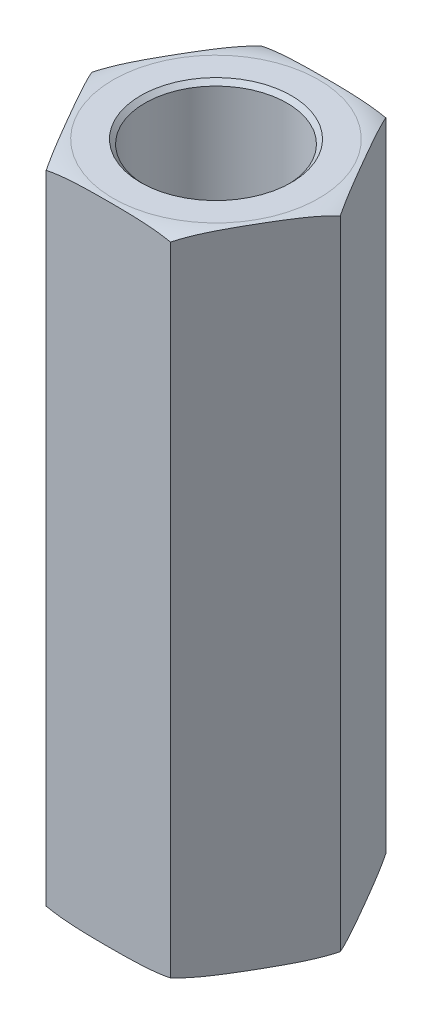
ISO-10303-21;
HEADER;
FILE_DESCRIPTION(('STEP AP214'),'2;1');
FILE_NAME('part.step','',(''),(''),'','','');
FILE_SCHEMA(('AUTOMOTIVE_DESIGN { 1 0 10303 214 1 1 1 1 }'));
ENDSEC;
DATA;
#1=APPLICATION_CONTEXT('core data for automotive mechanical design processes');
#2=APPLICATION_PROTOCOL_DEFINITION('international standard','automotive_design',2000,#1);
#3=PRODUCT_CONTEXT('',#1,'mechanical');
#4=PRODUCT('Part','Part','',(#3));
#5=PRODUCT_RELATED_PRODUCT_CATEGORY('part','',(#4));
#6=PRODUCT_DEFINITION_FORMATION('','',#4);
#7=PRODUCT_DEFINITION_CONTEXT('part definition',#1,'design');
#8=PRODUCT_DEFINITION('design','',#6,#7);
#9=PRODUCT_DEFINITION_SHAPE('','',#8);
#10=(LENGTH_UNIT() NAMED_UNIT(*) SI_UNIT(.MILLI.,.METRE.));
#11=(NAMED_UNIT(*) PLANE_ANGLE_UNIT() SI_UNIT($,.RADIAN.));
#12=(NAMED_UNIT(*) SI_UNIT($,.STERADIAN.) SOLID_ANGLE_UNIT());
#13=UNCERTAINTY_MEASURE_WITH_UNIT(LENGTH_MEASURE(1.E-05),#10,'distance_accuracy_value','');
#14=(GEOMETRIC_REPRESENTATION_CONTEXT(3) GLOBAL_UNCERTAINTY_ASSIGNED_CONTEXT((#13)) GLOBAL_UNIT_ASSIGNED_CONTEXT((#10,
#11,#12)) REPRESENTATION_CONTEXT('',''));
#15=CARTESIAN_POINT('',(0.,0.,0.));
#16=DIRECTION('',(0.,0.,1.));
#17=DIRECTION('',(1.,0.,0.));
#18=AXIS2_PLACEMENT_3D('',#15,#16,#17);
#19=CARTESIAN_POINT('',(3.66617420935412,9.525,0.));
#20=DIRECTION('',(-0.866025403784439,0.,0.5));
#21=DIRECTION('',(0.5,0.,0.866025403784439));
#22=AXIS2_PLACEMENT_3D('',#19,#20,#21);
#23=PLANE('',#22);
#24=CARTESIAN_POINT('',(3.66617420935412,9.398,0.));
#25=CARTESIAN_POINT('',(3.63753042799203,9.40993202468709,-0.0496124846400275));
#26=CARTESIAN_POINT('',(3.60875945805376,9.42055614694223,-0.0994452663561576));
#27=CARTESIAN_POINT('',(3.5510445941875,9.43952869380446,-0.199410342924434));
#28=CARTESIAN_POINT('',(3.52210079717004,9.44787829008084,-0.249542469922636));
#29=CARTESIAN_POINT('',(3.43520914920621,9.47001015084215,-0.400043218949384));
#30=CARTESIAN_POINT('',(3.37708055050429,9.48092253839952,-0.500724905273881));
#31=CARTESIAN_POINT('',(3.26070078255249,9.4975474670846,-0.702300576339476));
#32=CARTESIAN_POINT('',(3.20244972255356,9.50326351393611,-0.803194371852361));
#33=CARTESIAN_POINT('',(3.08586365366197,9.51154325238667,-1.00512736662733));
#34=CARTESIAN_POINT('',(3.02752861562773,9.5141051045623,-1.1061666163641));
#35=CARTESIAN_POINT('',(2.91138213832281,9.5174800878033,-1.30733821617637));
#36=CARTESIAN_POINT('',(2.85357078573453,9.51830898530758,-1.40747041611355));
#37=CARTESIAN_POINT('',(2.73795502274299,9.51890235146376,-1.60772279177072));
#38=CARTESIAN_POINT('',(2.68015061252642,9.51866697200316,-1.70784296716739));
#39=CARTESIAN_POINT('',(2.56452713843041,9.51693398748164,-1.9081086988493));
#40=CARTESIAN_POINT('',(2.50670807591217,9.51543597123025,-2.00825425277689));
#41=CARTESIAN_POINT('',(2.39109525560102,9.51017531674577,-2.20850153156214));
#42=CARTESIAN_POINT('',(2.33330149587798,9.50641290136093,-2.30860325976287));
#43=CARTESIAN_POINT('',(2.23849359853911,9.49698899303816,-2.47281535491256));
#44=CARTESIAN_POINT('',(2.20145192539195,9.49249057663768,-2.5369734148008));
#45=CARTESIAN_POINT('',(2.12747060706785,9.48130148199487,-2.66511281694908));
#46=CARTESIAN_POINT('',(2.09053091530161,9.47461207209161,-2.72909423990413));
#47=CARTESIAN_POINT('',(2.01669860633929,9.45839780386584,-2.85697555026699));
#48=CARTESIAN_POINT('',(1.97980639337021,9.44886525006224,-2.92087473753309));
#49=CARTESIAN_POINT('',(1.90623831426152,9.42626291445617,-3.04829838836459));
#50=CARTESIAN_POINT('',(1.86956287153406,9.41318767878213,-3.11182211855863));
#51=CARTESIAN_POINT('',(1.83308710467706,9.398,-3.175));
#52=B_SPLINE_CURVE_WITH_KNOTS('',3,(#24,#25,#26,#27,#28,#29,#30,#31,#32,#33,#34,#35,#36,#37,#38,
#39,#40,#41,#42,#43,#44,#45,#46,#47,#48,#49,#50,#51),.UNSPECIFIED.,.F.,.F.,(4,2,2,2,2,2,2,2,2,2,
2,2,2,4),(0.,0.17550946738822,0.350928353443244,0.701031261588482,1.05089779629354,
1.40096826525493,1.74783967758031,2.09466158796881,2.44159648808703,2.78849725058543,
3.0111319819994,3.23363806003511,3.45675194236245,3.68021127402553),.UNSPECIFIED.);
#53=CARTESIAN_POINT('',(3.66617420935412,9.398,0.));
#54=VERTEX_POINT('',#53);
#55=CARTESIAN_POINT('',(1.83308710467706,9.398,-3.175));
#56=VERTEX_POINT('',#55);
#57=EDGE_CURVE('E106',#54,#56,#52,.T.);
#58=ORIENTED_EDGE('',*,*,#57,.F.);
#59=DIRECTION('',(0.,1.,0.));
#60=VECTOR('',#59,1.);
#61=CARTESIAN_POINT('',(3.66617420935412,9.525,0.));
#62=LINE('',#61,#60);
#63=CARTESIAN_POINT('',(3.66617420935412,-9.398,0.));
#64=VERTEX_POINT('',#63);
#65=EDGE_CURVE('E79',#54,#64,#62,.F.);
#66=ORIENTED_EDGE('',*,*,#65,.T.);
#67=CARTESIAN_POINT('',(1.83308710467705,-9.398,-3.17500000000001));
#68=CARTESIAN_POINT('',(1.86173088603914,-9.40993202468709,-3.12538751535998));
#69=CARTESIAN_POINT('',(1.89050185597741,-9.42055614694223,-3.07555473364385));
#70=CARTESIAN_POINT('',(1.94821671984367,-9.43952869380445,-2.97558965707558));
#71=CARTESIAN_POINT('',(1.97716051686113,-9.44787829008084,-2.92545753007738));
#72=CARTESIAN_POINT('',(2.06405216482496,-9.47001015084215,-2.77495678105063));
#73=CARTESIAN_POINT('',(2.12218076352687,-9.48092253839952,-2.67427509472614));
#74=CARTESIAN_POINT('',(2.23856053147867,-9.4975474670846,-2.47269942366054));
#75=CARTESIAN_POINT('',(2.2968115914776,-9.50326351393611,-2.37180562814766));
#76=CARTESIAN_POINT('',(2.41339766036919,-9.51154325238667,-2.1698726333727));
#77=CARTESIAN_POINT('',(2.47173269840343,-9.5141051045623,-2.06883338363593));
#78=CARTESIAN_POINT('',(2.58787917570835,-9.5174800878033,-1.86766178382366));
#79=CARTESIAN_POINT('',(2.64569052829663,-9.51830898530758,-1.76752958388648));
#80=CARTESIAN_POINT('',(2.76130629128816,-9.51890235146376,-1.56727720822931));
#81=CARTESIAN_POINT('',(2.81911070150473,-9.51866697200316,-1.46715703283265));
#82=CARTESIAN_POINT('',(2.93473417560074,-9.51693398748165,-1.26689130115074));
#83=CARTESIAN_POINT('',(2.99255323811898,-9.51543597123026,-1.16674574722316));
#84=CARTESIAN_POINT('',(3.10816605843013,-9.51017531674577,-0.966498468437907));
#85=CARTESIAN_POINT('',(3.16595981815317,-9.50641290136093,-0.866396740237176));
#86=CARTESIAN_POINT('',(3.26076771549203,-9.49698899303816,-0.702184645087488));
#87=CARTESIAN_POINT('',(3.2978093886392,-9.49249057663768,-0.63802658519924));
#88=CARTESIAN_POINT('',(3.37179070696331,-9.48130148199488,-0.509887183050958));
#89=CARTESIAN_POINT('',(3.40873039872954,-9.47461207209161,-0.445905760095904));
#90=CARTESIAN_POINT('',(3.48256270769187,-9.45839780386584,-0.318024449733033));
#91=CARTESIAN_POINT('',(3.51945492066095,-9.44886525006225,-0.254125262466928));
#92=CARTESIAN_POINT('',(3.59302299976965,-9.42626291445618,-0.126701611635421));
#93=CARTESIAN_POINT('',(3.62969844249711,-9.41318767878214,-0.0631778814413773));
#94=CARTESIAN_POINT('',(3.66617420935412,-9.398,0.));
#95=B_SPLINE_CURVE_WITH_KNOTS('',3,(#67,#68,#69,#70,#71,#72,#73,#74,#75,#76,#77,#78,#79,#80,#81,
#82,#83,#84,#85,#86,#87,#88,#89,#90,#91,#92,#93,#94),.UNSPECIFIED.,.F.,.F.,(4,2,2,2,2,2,2,2,2,2,
2,2,2,4),(0.,0.175509467388216,0.350928353443236,0.701031261588468,1.05089779629352,
1.4009682652549,1.74783967758028,2.09466158796877,2.44159648808698,2.78849725058538,
3.01113198199936,3.23363806003509,3.45675194236244,3.68021127402553),.UNSPECIFIED.);
#96=CARTESIAN_POINT('',(1.83308710467705,-9.398,-3.175));
#97=VERTEX_POINT('',#96);
#98=EDGE_CURVE('E96',#97,#64,#95,.T.);
#99=ORIENTED_EDGE('',*,*,#98,.F.);
#100=DIRECTION('',(0.,1.,0.));
#101=VECTOR('',#100,1.);
#102=CARTESIAN_POINT('',(1.83308710467705,9.525,-3.175));
#103=LINE('',#102,#101);
#104=EDGE_CURVE('E110',#97,#56,#103,.T.);
#105=ORIENTED_EDGE('',*,*,#104,.T.);
#106=EDGE_LOOP('',(#58,#66,#99,#105));
#107=FACE_BOUND('',#106,.T.);
#108=ADVANCED_FACE('F16',(#107),#23,.F.);
#109=CARTESIAN_POINT('',(1.83308710467706,9.525,3.17499999999999));
#110=DIRECTION('',(-0.866025403784439,0.,-0.5));
#111=DIRECTION('',(-0.5,0.,0.866025403784439));
#112=AXIS2_PLACEMENT_3D('',#109,#110,#111);
#113=PLANE('',#112);
#114=CARTESIAN_POINT('',(1.83308710467706,9.398,3.17499999999999));
#115=CARTESIAN_POINT('',(1.86173088603915,9.40993202468709,3.12538751535996));
#116=CARTESIAN_POINT('',(1.89050185597743,9.42055614694223,3.07555473364383));
#117=CARTESIAN_POINT('',(1.94821671984368,9.43952869380446,2.97558965707556));
#118=CARTESIAN_POINT('',(1.97716051686114,9.44787829008084,2.92545753007735));
#119=CARTESIAN_POINT('',(2.06405216482498,9.47001015084215,2.77495678105061));
#120=CARTESIAN_POINT('',(2.12218076352689,9.48092253839952,2.67427509472611));
#121=CARTESIAN_POINT('',(2.23856053147869,9.4975474670846,2.47269942366051));
#122=CARTESIAN_POINT('',(2.29681159147762,9.50326351393611,2.37180562814763));
#123=CARTESIAN_POINT('',(2.41339766036921,9.51154325238667,2.16987263337266));
#124=CARTESIAN_POINT('',(2.47173269840345,9.5141051045623,2.06883338363589));
#125=CARTESIAN_POINT('',(2.58787917570837,9.5174800878033,1.86766178382362));
#126=CARTESIAN_POINT('',(2.64569052829666,9.51830898530758,1.76752958388644));
#127=CARTESIAN_POINT('',(2.76130629128819,9.51890235146376,1.56727720822927));
#128=CARTESIAN_POINT('',(2.81911070150476,9.51866697200316,1.4671570328326));
#129=CARTESIAN_POINT('',(2.93473417560078,9.51693398748164,1.26689130115069));
#130=CARTESIAN_POINT('',(2.99255323811901,9.51543597123025,1.1667457472231));
#131=CARTESIAN_POINT('',(3.10816605843017,9.51017531674577,0.966498468437848));
#132=CARTESIAN_POINT('',(3.16595981815321,9.50641290136093,0.866396740237115));
#133=CARTESIAN_POINT('',(3.26076771549207,9.49698899303816,0.702184645087431));
#134=CARTESIAN_POINT('',(3.29780938863923,9.49249057663768,0.638026585199189));
#135=CARTESIAN_POINT('',(3.37179070696333,9.48130148199487,0.509887183050919));
#136=CARTESIAN_POINT('',(3.40873039872956,9.47461207209161,0.44590576009587));
#137=CARTESIAN_POINT('',(3.48256270769188,9.45839780386584,0.31802444973301));
#138=CARTESIAN_POINT('',(3.51945492066096,9.44886525006224,0.254125262466912));
#139=CARTESIAN_POINT('',(3.59302299976965,9.42626291445617,0.126701611635416));
#140=CARTESIAN_POINT('',(3.62969844249711,9.41318767878213,0.0631778814413771));
#141=CARTESIAN_POINT('',(3.66617420935412,9.398,0.));
#142=B_SPLINE_CURVE_WITH_KNOTS('',3,(#114,#115,#116,#117,#118,#119,#120,#121,#122,#123,#124,
#125,#126,#127,#128,#129,#130,#131,#132,#133,#134,#135,#136,#137,#138,#139,#140,#141),
.UNSPECIFIED.,.F.,.F.,(4,2,2,2,2,2,2,2,2,2,2,2,2,4),(0.,0.17550946738822,0.350928353443244,
0.701031261588483,1.05089779629354,1.40096826525493,1.74783967758031,2.09466158796881,
2.44159648808703,2.78849725058544,3.01113198199939,3.2336380600351,3.45675194236244,
3.68021127402551),.UNSPECIFIED.);
#143=CARTESIAN_POINT('',(1.83308710467707,9.398,3.17499999999999));
#144=VERTEX_POINT('',#143);
#145=EDGE_CURVE('E21',#144,#54,#142,.T.);
#146=ORIENTED_EDGE('',*,*,#145,.F.);
#147=DIRECTION('',(0.,1.,0.));
#148=VECTOR('',#147,1.);
#149=CARTESIAN_POINT('',(1.83308710467707,9.525,3.17499999999999));
#150=LINE('',#149,#148);
#151=CARTESIAN_POINT('',(1.83308710467706,-9.398,3.17499999999999));
#152=VERTEX_POINT('',#151);
#153=EDGE_CURVE('E99',#144,#152,#150,.F.);
#154=ORIENTED_EDGE('',*,*,#153,.T.);
#155=CARTESIAN_POINT('',(3.66617420935412,-9.398,0.));
#156=CARTESIAN_POINT('',(3.63753042799203,-9.40993202468709,0.0496124846400324));
#157=CARTESIAN_POINT('',(3.60875945805375,-9.42055614694223,0.0994452663561624));
#158=CARTESIAN_POINT('',(3.5510445941875,-9.43952869380445,0.199410342924438));
#159=CARTESIAN_POINT('',(3.52210079717004,-9.44787829008084,0.24954246992264));
#160=CARTESIAN_POINT('',(3.43520914920621,-9.47001015084215,0.400043218949389));
#161=CARTESIAN_POINT('',(3.37708055050429,-9.48092253839952,0.500724905273886));
#162=CARTESIAN_POINT('',(3.26070078255249,-9.4975474670846,0.702300576339482));
#163=CARTESIAN_POINT('',(3.20244972255356,-9.50326351393611,0.803194371852367));
#164=CARTESIAN_POINT('',(3.08586365366197,-9.51154325238667,1.00512736662734));
#165=CARTESIAN_POINT('',(3.02752861562773,-9.5141051045623,1.1061666163641));
#166=CARTESIAN_POINT('',(2.91138213832281,-9.5174800878033,1.30733821617637));
#167=CARTESIAN_POINT('',(2.85357078573452,-9.51830898530758,1.40747041611356));
#168=CARTESIAN_POINT('',(2.73795502274299,-9.51890235146376,1.60772279177073));
#169=CARTESIAN_POINT('',(2.68015061252642,-9.51866697200316,1.70784296716739));
#170=CARTESIAN_POINT('',(2.5645271384304,-9.51693398748164,1.90810869884931));
#171=CARTESIAN_POINT('',(2.50670807591217,-9.51543597123025,2.00825425277689));
#172=CARTESIAN_POINT('',(2.39109525560101,-9.51017531674577,2.20850153156215));
#173=CARTESIAN_POINT('',(2.33330149587797,-9.50641290136093,2.30860325976288));
#174=CARTESIAN_POINT('',(2.23849359853911,-9.49698899303816,2.47281535491257));
#175=CARTESIAN_POINT('',(2.20145192539195,-9.49249057663768,2.53697341480081));
#176=CARTESIAN_POINT('',(2.12747060706785,-9.48130148199487,2.66511281694908));
#177=CARTESIAN_POINT('',(2.09053091530162,-9.47461207209161,2.72909423990413));
#178=CARTESIAN_POINT('',(2.0166986063393,-9.45839780386584,2.85697555026699));
#179=CARTESIAN_POINT('',(1.97980639337022,-9.44886525006225,2.92087473753308));
#180=CARTESIAN_POINT('',(1.90623831426153,-9.42626291445618,3.04829838836458));
#181=CARTESIAN_POINT('',(1.86956287153407,-9.41318767878214,3.11182211855862));
#182=CARTESIAN_POINT('',(1.83308710467706,-9.398,3.17499999999999));
#183=B_SPLINE_CURVE_WITH_KNOTS('',3,(#155,#156,#157,#158,#159,#160,#161,#162,#163,#164,#165,
#166,#167,#168,#169,#170,#171,#172,#173,#174,#175,#176,#177,#178,#179,#180,#181,#182),
.UNSPECIFIED.,.F.,.F.,(4,2,2,2,2,2,2,2,2,2,2,2,2,4),(0.,0.175509467388219,0.350928353443244,
0.701031261588483,1.05089779629354,1.40096826525493,1.74783967758031,2.09466158796881,
2.44159648808703,2.78849725058544,3.01113198199939,3.2336380600351,3.45675194236244,
3.68021127402551),.UNSPECIFIED.);
#184=EDGE_CURVE('E204',#64,#152,#183,.T.);
#185=ORIENTED_EDGE('',*,*,#184,.F.);
#186=ORIENTED_EDGE('',*,*,#65,.F.);
#187=EDGE_LOOP('',(#146,#154,#185,#186));
#188=FACE_BOUND('',#187,.T.);
#189=ADVANCED_FACE('F105',(#188),#113,.F.);
#190=CARTESIAN_POINT('',(-1.83308710467707,9.525,3.175));
#191=DIRECTION('',(0.,0.,-1.));
#192=DIRECTION('',(-1.,0.,0.));
#193=AXIS2_PLACEMENT_3D('',#190,#191,#192);
#194=PLANE('',#193);
#195=ORIENTED_EDGE('',*,*,#153,.F.);
#196=CARTESIAN_POINT('',(-1.83308710467707,9.39799999999999,3.175));
#197=CARTESIAN_POINT('',(-1.75760871054776,9.41371230122365,3.175));
#198=CARTESIAN_POINT('',(-1.68170571468658,9.4271647800808,3.175));
#199=CARTESIAN_POINT('',(-1.52939807527773,9.45030486470105,3.175));
#200=CARTESIAN_POINT('',(-1.45299400110163,9.45999617502722,3.175));
#201=CARTESIAN_POINT('',(-1.30011823209763,9.47637135267139,3.175));
#202=CARTESIAN_POINT('',(-1.22364747610196,9.48306442247852,3.175));
#203=CARTESIAN_POINT('',(-1.07052459410173,9.49417241699752,3.175));
#204=CARTESIAN_POINT('',(-0.993872424115956,9.49858671655426,3.175));
#205=CARTESIAN_POINT('',(-0.840856910195845,9.50572419802799,3.175));
#206=CARTESIAN_POINT('',(-0.764493913329281,9.50845527367792,3.175));
#207=CARTESIAN_POINT('',(-0.611734616938516,9.51275632258004,3.175));
#208=CARTESIAN_POINT('',(-0.535338316331409,9.51432625473884,3.175));
#209=CARTESIAN_POINT('',(-0.38245423122642,9.51668247076568,3.175));
#210=CARTESIAN_POINT('',(-0.305966435115039,9.51746792759645,3.175));
#211=CARTESIAN_POINT('',(-0.152985759387012,9.51848841069005,3.175));
#212=CARTESIAN_POINT('',(-0.076492879693506,9.51872342414921,3.175));
#213=CARTESIAN_POINT('',(0.0764928796935065,9.51872342414921,3.175));
#214=CARTESIAN_POINT('',(0.152985759387013,9.51848841069005,3.17499999999999));
#215=CARTESIAN_POINT('',(0.305966435115039,9.51746792759645,3.17499999999999));
#216=CARTESIAN_POINT('',(0.38245423122642,9.51668247076568,3.17499999999999));
#217=CARTESIAN_POINT('',(0.535338316331409,9.51432625473884,3.17499999999999));
#218=CARTESIAN_POINT('',(0.611734616938516,9.51275632258004,3.17499999999999));
#219=CARTESIAN_POINT('',(0.764493913329281,9.50845527367792,3.17499999999999));
#220=CARTESIAN_POINT('',(0.840856910195845,9.50572419802799,3.17499999999999));
#221=CARTESIAN_POINT('',(0.993872424115955,9.49858671655426,3.17499999999999));
#222=CARTESIAN_POINT('',(1.07052459410172,9.49417241699752,3.17499999999999));
#223=CARTESIAN_POINT('',(1.22364747610196,9.48306442247852,3.17499999999999));
#224=CARTESIAN_POINT('',(1.30011823209763,9.47637135267139,3.17499999999999));
#225=CARTESIAN_POINT('',(1.45299400110163,9.45999617502723,3.17499999999999));
#226=CARTESIAN_POINT('',(1.52939807527773,9.45030486470105,3.17499999999999));
#227=CARTESIAN_POINT('',(1.68170571468658,9.42716478008081,3.17499999999999));
#228=CARTESIAN_POINT('',(1.75760871054776,9.41371230122365,3.17499999999999));
#229=CARTESIAN_POINT('',(1.83308710467707,9.398,3.17499999999999));
#230=B_SPLINE_CURVE_WITH_KNOTS('',3,(#196,#197,#198,#199,#200,#201,#202,#203,#204,#205,#206,
#207,#208,#209,#210,#211,#212,#213,#214,#215,#216,#217,#218,#219,#220,#221,#222,#223,#224,#225,
#226,#227,#228,#229),.UNSPECIFIED.,.F.,.F.,(4,2,2,2,2,2,2,2,2,2,2,2,2,2,2,2,4),(0.,
0.23119079437731,0.46215329593589,0.692401964780504,0.922713766248053,1.15193709952408,
1.3811685447265,1.61064140410055,1.84011960111017,2.06959779811978,2.29907065749383,
2.52830210269626,2.75752543597228,2.98783723743982,3.21808590628444,3.44904840784302,
3.68023920222033),.UNSPECIFIED.);
#231=CARTESIAN_POINT('',(-1.83308710467707,9.398,3.175));
#232=VERTEX_POINT('',#231);
#233=EDGE_CURVE('E85',#232,#144,#230,.T.);
#234=ORIENTED_EDGE('',*,*,#233,.F.);
#235=DIRECTION('',(0.,1.,0.));
#236=VECTOR('',#235,1.);
#237=CARTESIAN_POINT('',(-1.83308710467707,9.525,3.175));
#238=LINE('',#237,#236);
#239=CARTESIAN_POINT('',(-1.83308710467707,-9.398,3.175));
#240=VERTEX_POINT('',#239);
#241=EDGE_CURVE('E103',#232,#240,#238,.F.);
#242=ORIENTED_EDGE('',*,*,#241,.T.);
#243=CARTESIAN_POINT('',(1.83308710467706,-9.398,3.17499999999999));
#244=CARTESIAN_POINT('',(1.75760871054776,-9.41371230122365,3.17499999999999));
#245=CARTESIAN_POINT('',(1.68170571468658,-9.42716478008081,3.17499999999999));
#246=CARTESIAN_POINT('',(1.52939807527773,-9.45030486470105,3.17499999999999));
#247=CARTESIAN_POINT('',(1.45299400110163,-9.45999617502723,3.17499999999999));
#248=CARTESIAN_POINT('',(1.30011823209763,-9.47637135267139,3.17499999999999));
#249=CARTESIAN_POINT('',(1.22364747610196,-9.48306442247852,3.17499999999999));
#250=CARTESIAN_POINT('',(1.07052459410172,-9.49417241699752,3.17499999999999));
#251=CARTESIAN_POINT('',(0.993872424115954,-9.49858671655426,3.17499999999999));
#252=CARTESIAN_POINT('',(0.840856910195844,-9.50572419802799,3.17499999999999));
#253=CARTESIAN_POINT('',(0.76449391332928,-9.50845527367792,3.17499999999999));
#254=CARTESIAN_POINT('',(0.611734616938514,-9.51275632258004,3.17499999999999));
#255=CARTESIAN_POINT('',(0.535338316331408,-9.51432625473884,3.17499999999999));
#256=CARTESIAN_POINT('',(0.382454231226419,-9.51668247076568,3.17499999999999));
#257=CARTESIAN_POINT('',(0.305966435115038,-9.51746792759645,3.17499999999999));
#258=CARTESIAN_POINT('',(0.152985759387012,-9.51848841069005,3.17499999999999));
#259=CARTESIAN_POINT('',(0.076492879693506,-9.51872342414921,3.175));
#260=CARTESIAN_POINT('',(-0.0764928796935062,-9.51872342414921,3.175));
#261=CARTESIAN_POINT('',(-0.152985759387012,-9.51848841069005,3.175));
#262=CARTESIAN_POINT('',(-0.305966435115038,-9.51746792759645,3.175));
#263=CARTESIAN_POINT('',(-0.382454231226419,-9.51668247076568,3.175));
#264=CARTESIAN_POINT('',(-0.535338316331408,-9.51432625473884,3.175));
#265=CARTESIAN_POINT('',(-0.611734616938515,-9.51275632258004,3.175));
#266=CARTESIAN_POINT('',(-0.76449391332928,-9.50845527367792,3.175));
#267=CARTESIAN_POINT('',(-0.840856910195844,-9.50572419802799,3.175));
#268=CARTESIAN_POINT('',(-0.993872424115954,-9.49858671655426,3.175));
#269=CARTESIAN_POINT('',(-1.07052459410172,-9.49417241699752,3.175));
#270=CARTESIAN_POINT('',(-1.22364747610196,-9.48306442247852,3.175));
#271=CARTESIAN_POINT('',(-1.30011823209763,-9.47637135267139,3.175));
#272=CARTESIAN_POINT('',(-1.45299400110163,-9.45999617502722,3.175));
#273=CARTESIAN_POINT('',(-1.52939807527773,-9.45030486470105,3.175));
#274=CARTESIAN_POINT('',(-1.68170571468658,-9.4271647800808,3.175));
#275=CARTESIAN_POINT('',(-1.75760871054776,-9.41371230122365,3.175));
#276=CARTESIAN_POINT('',(-1.83308710467706,-9.398,3.175));
#277=B_SPLINE_CURVE_WITH_KNOTS('',3,(#243,#244,#245,#246,#247,#248,#249,#250,#251,#252,#253,
#254,#255,#256,#257,#258,#259,#260,#261,#262,#263,#264,#265,#266,#267,#268,#269,#270,#271,#272,
#273,#274,#275,#276),.UNSPECIFIED.,.F.,.F.,(4,2,2,2,2,2,2,2,2,2,2,2,2,2,2,2,4),(0.,
0.23119079437731,0.462153295935889,0.692401964780503,0.922713766248051,1.15193709952407,
1.3811685447265,1.61064140410055,1.84011960111016,2.06959779811977,2.29907065749383,
2.52830210269625,2.75752543597227,2.98783723743982,3.21808590628443,3.44904840784301,
3.68023920222032),.UNSPECIFIED.);
#278=EDGE_CURVE('E101',#152,#240,#277,.T.);
#279=ORIENTED_EDGE('',*,*,#278,.F.);
#280=EDGE_LOOP('',(#195,#234,#242,#279));
#281=FACE_BOUND('',#280,.T.);
#282=ADVANCED_FACE('F100',(#281),#194,.F.);
#283=CARTESIAN_POINT('',(-3.66617420935413,9.525,0.));
#284=DIRECTION('',(0.866025403784439,0.,-0.499999999999999));
#285=DIRECTION('',(-0.499999999999999,0.,-0.866025403784439));
#286=AXIS2_PLACEMENT_3D('',#283,#284,#285);
#287=PLANE('',#286);
#288=CARTESIAN_POINT('',(-3.66617420935412,9.39799999999999,0.));
#289=CARTESIAN_POINT('',(-3.63753042799204,9.40993202468708,0.0496124846400222));
#290=CARTESIAN_POINT('',(-3.60875945805377,9.42055614694222,0.0994452663561455));
#291=CARTESIAN_POINT('',(-3.55104459418752,9.43952869380445,0.199410342924408));
#292=CARTESIAN_POINT('',(-3.52210079717006,9.44787829008083,0.249542469922603));
#293=CARTESIAN_POINT('',(-3.43520914920624,9.47001015084215,0.400043218949332));
#294=CARTESIAN_POINT('',(-3.37708055050434,9.48092253839951,0.500724905273816));
#295=CARTESIAN_POINT('',(-3.26070078255255,9.4975474670846,0.702300576339384));
#296=CARTESIAN_POINT('',(-3.20244972255363,9.50326351393611,0.803194371852256));
#297=CARTESIAN_POINT('',(-3.08586365366205,9.51154325238667,1.0051273666272));
#298=CARTESIAN_POINT('',(-3.02752861562782,9.5141051045623,1.10616661636395));
#299=CARTESIAN_POINT('',(-2.91138213832292,9.5174800878033,1.30733821617619));
#300=CARTESIAN_POINT('',(-2.85357078573464,9.51830898530758,1.40747041611336));
#301=CARTESIAN_POINT('',(-2.73795502274313,9.51890235146376,1.60772279177051));
#302=CARTESIAN_POINT('',(-2.68015061252656,9.51866697200317,1.70784296716716));
#303=CARTESIAN_POINT('',(-2.56452713843056,9.51693398748165,1.90810869884905));
#304=CARTESIAN_POINT('',(-2.50670807591233,9.51543597123026,2.00825425277662));
#305=CARTESIAN_POINT('',(-2.39109525560119,9.51017531674578,2.20850153156185));
#306=CARTESIAN_POINT('',(-2.33330149587816,9.50641290136095,2.30860325976257));
#307=CARTESIAN_POINT('',(-2.23849359853929,9.49698899303818,2.47281535491227));
#308=CARTESIAN_POINT('',(-2.20145192539211,9.4924905766377,2.53697341480054));
#309=CARTESIAN_POINT('',(-2.12747060706798,9.48130148199489,2.66511281694887));
#310=CARTESIAN_POINT('',(-2.09053091530173,9.47461207209163,2.72909423990394));
#311=CARTESIAN_POINT('',(-2.01669860633938,9.45839780386585,2.85697555026686));
#312=CARTESIAN_POINT('',(-1.97980639337028,9.44886525006226,2.92087473753298));
#313=CARTESIAN_POINT('',(-1.90623831426156,9.42626291445618,3.04829838836453));
#314=CARTESIAN_POINT('',(-1.86956287153409,9.41318767878214,3.1118221185586));
#315=CARTESIAN_POINT('',(-1.83308710467707,9.39799999999999,3.175));
#316=B_SPLINE_CURVE_WITH_KNOTS('',3,(#288,#289,#290,#291,#292,#293,#294,#295,#296,#297,#298,
#299,#300,#301,#302,#303,#304,#305,#306,#307,#308,#309,#310,#311,#312,#313,#314,#315),
.UNSPECIFIED.,.F.,.F.,(4,2,2,2,2,2,2,2,2,2,2,2,2,4),(0.,0.175509467388196,0.350928353443197,
0.70103126158839,1.0508977962934,1.40096826525474,1.74783967758008,2.09466158796853,
2.4415964880867,2.78849725058507,3.01113198199912,3.23363806003492,3.45675194236235,
3.68021127402552),.UNSPECIFIED.);
#317=CARTESIAN_POINT('',(-3.66617420935413,9.39799999999999,0.));
#318=VERTEX_POINT('',#317);
#319=EDGE_CURVE('E93',#318,#232,#316,.T.);
#320=ORIENTED_EDGE('',*,*,#319,.F.);
#321=DIRECTION('',(0.,1.,0.));
#322=VECTOR('',#321,1.);
#323=CARTESIAN_POINT('',(-3.66617420935413,9.525,0.));
#324=LINE('',#323,#322);
#325=CARTESIAN_POINT('',(-3.66617420935413,-9.398,0.));
#326=VERTEX_POINT('',#325);
#327=EDGE_CURVE('E117',#318,#326,#324,.F.);
#328=ORIENTED_EDGE('',*,*,#327,.T.);
#329=CARTESIAN_POINT('',(-1.83308710467707,-9.39799999999999,3.175));
#330=CARTESIAN_POINT('',(-1.86173088603915,-9.40993202468708,3.12538751535998));
#331=CARTESIAN_POINT('',(-1.89050185597742,-9.42055614694222,3.07555473364385));
#332=CARTESIAN_POINT('',(-1.94821671984367,-9.43952869380445,2.97558965707558));
#333=CARTESIAN_POINT('',(-1.97716051686113,-9.44787829008083,2.92545753007739));
#334=CARTESIAN_POINT('',(-2.06405216482496,-9.47001015084215,2.77495678105065));
#335=CARTESIAN_POINT('',(-2.12218076352686,-9.48092253839952,2.67427509472617));
#336=CARTESIAN_POINT('',(-2.23856053147865,-9.4975474670846,2.47269942366059));
#337=CARTESIAN_POINT('',(-2.29681159147757,-9.50326351393611,2.37180562814772));
#338=CARTESIAN_POINT('',(-2.41339766036916,-9.51154325238667,2.16987263337277));
#339=CARTESIAN_POINT('',(-2.47173269840339,-9.5141051045623,2.06883338363601));
#340=CARTESIAN_POINT('',(-2.5878791757083,-9.5174800878033,1.86766178382376));
#341=CARTESIAN_POINT('',(-2.64569052829658,-9.51830898530758,1.76752958388659));
#342=CARTESIAN_POINT('',(-2.7613062912881,-9.51890235146376,1.56727720822944));
#343=CARTESIAN_POINT('',(-2.81911070150467,-9.51866697200316,1.46715703283278));
#344=CARTESIAN_POINT('',(-2.93473417560067,-9.51693398748165,1.26689130115088));
#345=CARTESIAN_POINT('',(-2.9925532381189,-9.51543597123026,1.16674574722331));
#346=CARTESIAN_POINT('',(-3.10816605843004,-9.51017531674578,0.966498468438076));
#347=CARTESIAN_POINT('',(-3.16595981815307,-9.50641290136094,0.866396740237353));
#348=CARTESIAN_POINT('',(-3.26076771549194,-9.49698899303818,0.702184645087658));
#349=CARTESIAN_POINT('',(-3.29780938863912,-9.49249057663769,0.638026585199395));
#350=CARTESIAN_POINT('',(-3.37179070696324,-9.48130148199489,0.509887183051082));
#351=CARTESIAN_POINT('',(-3.40873039872949,-9.47461207209162,0.445905760096013));
#352=CARTESIAN_POINT('',(-3.48256270769183,-9.45839780386585,0.318024449733112));
#353=CARTESIAN_POINT('',(-3.51945492066092,-9.44886525006225,0.254125262466993));
#354=CARTESIAN_POINT('',(-3.59302299976963,-9.42626291445618,0.126701611635455));
#355=CARTESIAN_POINT('',(-3.6296984424971,-9.41318767878214,0.0631778814413959));
#356=CARTESIAN_POINT('',(-3.66617420935412,-9.398,0.));
#357=B_SPLINE_CURVE_WITH_KNOTS('',3,(#329,#330,#331,#332,#333,#334,#335,#336,#337,#338,#339,
#340,#341,#342,#343,#344,#345,#346,#347,#348,#349,#350,#351,#352,#353,#354,#355,#356),
.UNSPECIFIED.,.F.,.F.,(4,2,2,2,2,2,2,2,2,2,2,2,2,4),(0.,0.175509467388203,0.350928353443209,
0.701031261588413,1.05089779629344,1.40096826525479,1.74783967758014,2.0946615879686,
2.44159648808678,2.78849725058516,3.01113198199919,3.23363806003497,3.45675194236238,
3.68021127402552),.UNSPECIFIED.);
#358=EDGE_CURVE('E195',#240,#326,#357,.T.);
#359=ORIENTED_EDGE('',*,*,#358,.F.);
#360=ORIENTED_EDGE('',*,*,#241,.F.);
#361=EDGE_LOOP('',(#320,#328,#359,#360));
#362=FACE_BOUND('',#361,.T.);
#363=ADVANCED_FACE('F189',(#362),#287,.F.);
#364=CARTESIAN_POINT('',(-1.83308710467707,9.525,-3.175));
#365=DIRECTION('',(0.866025403784439,0.,0.5));
#366=DIRECTION('',(0.5,0.,-0.866025403784439));
#367=AXIS2_PLACEMENT_3D('',#364,#365,#366);
#368=PLANE('',#367);
#369=CARTESIAN_POINT('',(-1.83308710467706,9.39799999999999,-3.17500000000001));
#370=CARTESIAN_POINT('',(-1.86173088603915,9.40993202468708,-3.12538751535999));
#371=CARTESIAN_POINT('',(-1.89050185597742,9.42055614694222,-3.07555473364386));
#372=CARTESIAN_POINT('',(-1.94821671984366,9.43952869380445,-2.9755896570756));
#373=CARTESIAN_POINT('',(-1.97716051686112,9.44787829008083,-2.92545753007741));
#374=CARTESIAN_POINT('',(-2.06405216482494,9.47001015084215,-2.77495678105068));
#375=CARTESIAN_POINT('',(-2.12218076352685,9.48092253839951,-2.6742750947262));
#376=CARTESIAN_POINT('',(-2.23856053147863,9.4975474670846,-2.47269942366064));
#377=CARTESIAN_POINT('',(-2.29681159147755,9.50326351393611,-2.37180562814777));
#378=CARTESIAN_POINT('',(-2.41339766036912,9.51154325238667,-2.16987263337283));
#379=CARTESIAN_POINT('',(-2.47173269840336,9.5141051045623,-2.06883338363608));
#380=CARTESIAN_POINT('',(-2.58787917570826,9.5174800878033,-1.86766178382384));
#381=CARTESIAN_POINT('',(-2.64569052829653,9.51830898530758,-1.76752958388667));
#382=CARTESIAN_POINT('',(-2.76130629128805,9.51890235146376,-1.56727720822953));
#383=CARTESIAN_POINT('',(-2.81911070150462,9.51866697200317,-1.46715703283288));
#384=CARTESIAN_POINT('',(-2.93473417560061,9.51693398748165,-1.26689130115099));
#385=CARTESIAN_POINT('',(-2.99255323811884,9.51543597123026,-1.16674574722342));
#386=CARTESIAN_POINT('',(-3.10816605842998,9.51017531674579,-0.966498468438198));
#387=CARTESIAN_POINT('',(-3.16595981815301,9.50641290136095,-0.86639674023748));
#388=CARTESIAN_POINT('',(-3.26076771549188,9.49698899303819,-0.702184645087778));
#389=CARTESIAN_POINT('',(-3.29780938863906,9.4924905766377,-0.638026585199504));
#390=CARTESIAN_POINT('',(-3.3717907069632,9.4813014819949,-0.50988718305117));
#391=CARTESIAN_POINT('',(-3.40873039872945,9.47461207209163,-0.44590576009609));
#392=CARTESIAN_POINT('',(-3.4825627076918,9.45839780386586,-0.318024449733166));
#393=CARTESIAN_POINT('',(-3.5194549206609,9.44886525006226,-0.254125262467035));
#394=CARTESIAN_POINT('',(-3.59302299976963,9.42626291445618,-0.126701611635476));
#395=CARTESIAN_POINT('',(-3.6296984424971,9.41318767878213,-0.0631778814414058));
#396=CARTESIAN_POINT('',(-3.66617420935413,9.39799999999999,0.));
#397=B_SPLINE_CURVE_WITH_KNOTS('',3,(#369,#370,#371,#372,#373,#374,#375,#376,#377,#378,#379,
#380,#381,#382,#383,#384,#385,#386,#387,#388,#389,#390,#391,#392,#393,#394,#395,#396),
.UNSPECIFIED.,.F.,.F.,(4,2,2,2,2,2,2,2,2,2,2,2,2,4),(0.,0.175509467388193,0.350928353443191,
0.701031261588377,1.05089779629338,1.40096826525472,1.74783967758005,2.0946615879685,
2.44159648808666,2.78849725058502,3.01113198199908,3.2336380600349,3.45675194236235,
3.68021127402553),.UNSPECIFIED.);
#398=CARTESIAN_POINT('',(-1.83308710467706,9.398,-3.175));
#399=VERTEX_POINT('',#398);
#400=EDGE_CURVE('E165',#399,#318,#397,.T.);
#401=ORIENTED_EDGE('',*,*,#400,.F.);
#402=DIRECTION('',(0.,1.,0.));
#403=VECTOR('',#402,1.);
#404=CARTESIAN_POINT('',(-1.83308710467706,9.525,-3.175));
#405=LINE('',#404,#403);
#406=CARTESIAN_POINT('',(-1.83308710467707,-9.39799999999999,-3.175));
#407=VERTEX_POINT('',#406);
#408=EDGE_CURVE('E107',#399,#407,#405,.F.);
#409=ORIENTED_EDGE('',*,*,#408,.T.);
#410=CARTESIAN_POINT('',(-3.66617420935413,-9.39799999999999,0.));
#411=CARTESIAN_POINT('',(-3.63753042799204,-9.40993202468708,-0.0496124846400259));
#412=CARTESIAN_POINT('',(-3.60875945805377,-9.42055614694222,-0.0994452663561509));
#413=CARTESIAN_POINT('',(-3.55104459418752,-9.43952869380445,-0.199410342924416));
#414=CARTESIAN_POINT('',(-3.52210079717006,-9.44787829008083,-0.249542469922613));
#415=CARTESIAN_POINT('',(-3.43520914920624,-9.47001015084215,-0.400043218949346));
#416=CARTESIAN_POINT('',(-3.37708055050433,-9.48092253839952,-0.500724905273833));
#417=CARTESIAN_POINT('',(-3.26070078255254,-9.4975474670846,-0.702300576339408));
#418=CARTESIAN_POINT('',(-3.20244972255362,-9.50326351393611,-0.803194371852283));
#419=CARTESIAN_POINT('',(-3.08586365366204,-9.51154325238667,-1.00512736662723));
#420=CARTESIAN_POINT('',(-3.0275286156278,-9.5141051045623,-1.10616661636399));
#421=CARTESIAN_POINT('',(-2.91138213832289,-9.5174800878033,-1.30733821617624));
#422=CARTESIAN_POINT('',(-2.85357078573462,-9.51830898530758,-1.40747041611341));
#423=CARTESIAN_POINT('',(-2.7379550227431,-9.51890235146376,-1.60772279177056));
#424=CARTESIAN_POINT('',(-2.68015061252653,-9.51866697200316,-1.70784296716722));
#425=CARTESIAN_POINT('',(-2.56452713843053,-9.51693398748165,-1.90810869884911));
#426=CARTESIAN_POINT('',(-2.5067080759123,-9.51543597123026,-2.00825425277669));
#427=CARTESIAN_POINT('',(-2.39109525560115,-9.51017531674578,-2.20850153156192));
#428=CARTESIAN_POINT('',(-2.33330149587812,-9.50641290136094,-2.30860325976265));
#429=CARTESIAN_POINT('',(-2.23849359853925,-9.49698899303818,-2.47281535491234));
#430=CARTESIAN_POINT('',(-2.20145192539208,-9.49249057663769,-2.53697341480061));
#431=CARTESIAN_POINT('',(-2.12747060706795,-9.48130148199489,-2.66511281694892));
#432=CARTESIAN_POINT('',(-2.09053091530171,-9.47461207209162,-2.72909423990399));
#433=CARTESIAN_POINT('',(-2.01669860633936,-9.45839780386585,-2.85697555026689));
#434=CARTESIAN_POINT('',(-1.97980639337027,-9.44886525006225,-2.92087473753301));
#435=CARTESIAN_POINT('',(-1.90623831426156,-9.42626291445618,-3.04829838836455));
#436=CARTESIAN_POINT('',(-1.86956287153409,-9.41318767878213,-3.11182211855861));
#437=CARTESIAN_POINT('',(-1.83308710467707,-9.39799999999999,-3.175));
#438=B_SPLINE_CURVE_WITH_KNOTS('',3,(#410,#411,#412,#413,#414,#415,#416,#417,#418,#419,#420,
#421,#422,#423,#424,#425,#426,#427,#428,#429,#430,#431,#432,#433,#434,#435,#436,#437),
.UNSPECIFIED.,.F.,.F.,(4,2,2,2,2,2,2,2,2,2,2,2,2,4),(0.,0.175509467388202,0.350928353443208,
0.701031261588412,1.05089779629344,1.40096826525479,1.74783967758014,2.0946615879686,
2.44159648808678,2.78849725058516,3.01113198199919,3.23363806003497,3.45675194236238,
3.68021127402553),.UNSPECIFIED.);
#439=EDGE_CURVE('E141',#326,#407,#438,.T.);
#440=ORIENTED_EDGE('',*,*,#439,.F.);
#441=ORIENTED_EDGE('',*,*,#327,.F.);
#442=EDGE_LOOP('',(#401,#409,#440,#441));
#443=FACE_BOUND('',#442,.T.);
#444=ADVANCED_FACE('F151',(#443),#368,.F.);
#445=CARTESIAN_POINT('',(1.83308710467706,9.525,-3.175));
#446=DIRECTION('',(0.,0.,1.));
#447=DIRECTION('',(1.,0.,0.));
#448=AXIS2_PLACEMENT_3D('',#445,#446,#447);
#449=PLANE('',#448);
#450=CARTESIAN_POINT('',(1.83308710467705,9.398,-3.175));
#451=CARTESIAN_POINT('',(1.75760871054775,9.41371230122365,-3.175));
#452=CARTESIAN_POINT('',(1.68170571468657,9.4271647800808,-3.175));
#453=CARTESIAN_POINT('',(1.52939807527772,9.45030486470105,-3.175));
#454=CARTESIAN_POINT('',(1.45299400110162,9.45999617502722,-3.175));
#455=CARTESIAN_POINT('',(1.30011823209763,9.47637135267139,-3.175));
#456=CARTESIAN_POINT('',(1.22364747610195,9.48306442247852,-3.175));
#457=CARTESIAN_POINT('',(1.07052459410172,9.49417241699752,-3.175));
#458=CARTESIAN_POINT('',(0.99387242411595,9.49858671655426,-3.175));
#459=CARTESIAN_POINT('',(0.84085691019584,9.50572419802799,-3.175));
#460=CARTESIAN_POINT('',(0.764493913329277,9.50845527367792,-3.175));
#461=CARTESIAN_POINT('',(0.611734616938512,9.51275632258004,-3.175));
#462=CARTESIAN_POINT('',(0.535338316331406,9.51432625473884,-3.175));
#463=CARTESIAN_POINT('',(0.382454231226418,9.51668247076568,-3.175));
#464=CARTESIAN_POINT('',(0.305966435115037,9.51746792759645,-3.175));
#465=CARTESIAN_POINT('',(0.152985759387012,9.51848841069005,-3.175));
#466=CARTESIAN_POINT('',(0.0764928796935062,9.51872342414921,-3.175));
#467=CARTESIAN_POINT('',(-0.0764928796935054,9.51872342414921,-3.175));
#468=CARTESIAN_POINT('',(-0.152985759387011,9.51848841069005,-3.175));
#469=CARTESIAN_POINT('',(-0.305966435115037,9.51746792759645,-3.175));
#470=CARTESIAN_POINT('',(-0.382454231226418,9.51668247076568,-3.175));
#471=CARTESIAN_POINT('',(-0.535338316331406,9.51432625473884,-3.175));
#472=CARTESIAN_POINT('',(-0.611734616938512,9.51275632258004,-3.175));
#473=CARTESIAN_POINT('',(-0.764493913329277,9.50845527367792,-3.175));
#474=CARTESIAN_POINT('',(-0.840856910195841,9.50572419802799,-3.175));
#475=CARTESIAN_POINT('',(-0.99387242411595,9.49858671655426,-3.175));
#476=CARTESIAN_POINT('',(-1.07052459410172,9.49417241699752,-3.175));
#477=CARTESIAN_POINT('',(-1.22364747610195,9.48306442247852,-3.175));
#478=CARTESIAN_POINT('',(-1.30011823209763,9.47637135267139,-3.175));
#479=CARTESIAN_POINT('',(-1.45299400110163,9.45999617502722,-3.175));
#480=CARTESIAN_POINT('',(-1.52939807527772,9.45030486470105,-3.175));
#481=CARTESIAN_POINT('',(-1.68170571468657,9.4271647800808,-3.175));
#482=CARTESIAN_POINT('',(-1.75760871054775,9.41371230122365,-3.175));
#483=CARTESIAN_POINT('',(-1.83308710467706,9.39799999999999,-3.175));
#484=B_SPLINE_CURVE_WITH_KNOTS('',3,(#450,#451,#452,#453,#454,#455,#456,#457,#458,#459,#460,
#461,#462,#463,#464,#465,#466,#467,#468,#469,#470,#471,#472,#473,#474,#475,#476,#477,#478,#479,
#480,#481,#482,#483),.UNSPECIFIED.,.F.,.F.,(4,2,2,2,2,2,2,2,2,2,2,2,2,2,2,2,4),(0.,
0.231190794377309,0.462153295935887,0.6924019647805,0.922713766248047,1.15193709952407,
1.38116854472649,1.61064140410054,1.84011960111015,2.06959779811976,2.29907065749382,
2.52830210269624,2.75752543597226,2.98783723743981,3.21808590628442,3.449048407843,
3.68023920222031),.UNSPECIFIED.);
#485=EDGE_CURVE('E108',#56,#399,#484,.T.);
#486=ORIENTED_EDGE('',*,*,#485,.F.);
#487=ORIENTED_EDGE('',*,*,#104,.F.);
#488=CARTESIAN_POINT('',(-1.83308710467707,-9.39799999999999,-3.175));
#489=CARTESIAN_POINT('',(-1.75760871054776,-9.41371230122365,-3.175));
#490=CARTESIAN_POINT('',(-1.68170571468658,-9.4271647800808,-3.175));
#491=CARTESIAN_POINT('',(-1.52939807527773,-9.45030486470105,-3.175));
#492=CARTESIAN_POINT('',(-1.45299400110163,-9.45999617502722,-3.175));
#493=CARTESIAN_POINT('',(-1.30011823209763,-9.47637135267139,-3.175));
#494=CARTESIAN_POINT('',(-1.22364747610196,-9.48306442247852,-3.175));
#495=CARTESIAN_POINT('',(-1.07052459410173,-9.49417241699752,-3.175));
#496=CARTESIAN_POINT('',(-0.993872424115956,-9.49858671655426,-3.175));
#497=CARTESIAN_POINT('',(-0.840856910195846,-9.50572419802799,-3.175));
#498=CARTESIAN_POINT('',(-0.764493913329282,-9.50845527367792,-3.175));
#499=CARTESIAN_POINT('',(-0.611734616938516,-9.51275632258004,-3.175));
#500=CARTESIAN_POINT('',(-0.535338316331409,-9.51432625473884,-3.175));
#501=CARTESIAN_POINT('',(-0.38245423122642,-9.51668247076568,-3.175));
#502=CARTESIAN_POINT('',(-0.305966435115039,-9.51746792759645,-3.175));
#503=CARTESIAN_POINT('',(-0.152985759387013,-9.51848841069005,-3.175));
#504=CARTESIAN_POINT('',(-0.0764928796935069,-9.51872342414921,-3.175));
#505=CARTESIAN_POINT('',(0.0764928796935047,-9.51872342414921,-3.175));
#506=CARTESIAN_POINT('',(0.15298575938701,-9.51848841069005,-3.175));
#507=CARTESIAN_POINT('',(0.305966435115035,-9.51746792759645,-3.175));
#508=CARTESIAN_POINT('',(0.382454231226415,-9.51668247076568,-3.175));
#509=CARTESIAN_POINT('',(0.535338316331403,-9.51432625473884,-3.175));
#510=CARTESIAN_POINT('',(0.611734616938509,-9.51275632258004,-3.175));
#511=CARTESIAN_POINT('',(0.764493913329273,-9.50845527367792,-3.175));
#512=CARTESIAN_POINT('',(0.840856910195836,-9.50572419802799,-3.175));
#513=CARTESIAN_POINT('',(0.993872424115945,-9.49858671655426,-3.175));
#514=CARTESIAN_POINT('',(1.07052459410171,-9.49417241699752,-3.175));
#515=CARTESIAN_POINT('',(1.22364747610195,-9.48306442247852,-3.175));
#516=CARTESIAN_POINT('',(1.30011823209762,-9.47637135267139,-3.175));
#517=CARTESIAN_POINT('',(1.45299400110162,-9.45999617502722,-3.175));
#518=CARTESIAN_POINT('',(1.52939807527771,-9.45030486470105,-3.175));
#519=CARTESIAN_POINT('',(1.68170571468656,-9.4271647800808,-3.175));
#520=CARTESIAN_POINT('',(1.75760871054774,-9.41371230122365,-3.175));
#521=CARTESIAN_POINT('',(1.83308710467705,-9.398,-3.175));
#522=B_SPLINE_CURVE_WITH_KNOTS('',3,(#488,#489,#490,#491,#492,#493,#494,#495,#496,#497,#498,
#499,#500,#501,#502,#503,#504,#505,#506,#507,#508,#509,#510,#511,#512,#513,#514,#515,#516,#517,
#518,#519,#520,#521),.UNSPECIFIED.,.F.,.F.,(4,2,2,2,2,2,2,2,2,2,2,2,2,2,2,2,4),(0.,
0.23119079437731,0.46215329593589,0.692401964780504,0.922713766248052,1.15193709952407,
1.3811685447265,1.61064140410055,1.84011960111016,2.06959779811977,2.29907065749382,
2.52830210269625,2.75752543597227,2.98783723743981,3.21808590628442,3.449048407843,
3.68023920222031),.UNSPECIFIED.);
#523=EDGE_CURVE('E135',#407,#97,#522,.T.);
#524=ORIENTED_EDGE('',*,*,#523,.F.);
#525=ORIENTED_EDGE('',*,*,#408,.F.);
#526=EDGE_LOOP('',(#486,#487,#524,#525));
#527=FACE_BOUND('',#526,.T.);
#528=ADVANCED_FACE('F147',(#527),#449,.F.);
#529=CARTESIAN_POINT('',(0.,7.87400000000011,0.));
#530=DIRECTION('',(0.,1.,0.));
#531=DIRECTION('',(-1.,0.,0.));
#532=AXIS2_PLACEMENT_3D('',#529,#530,#531);
#533=TOROIDAL_SURFACE('',#532,3.03117420935412,1.65099999999989);
#534=ORIENTED_EDGE('',*,*,#57,.T.);
#535=ORIENTED_EDGE('',*,*,#485,.T.);
#536=ORIENTED_EDGE('',*,*,#400,.T.);
#537=ORIENTED_EDGE('',*,*,#319,.T.);
#538=ORIENTED_EDGE('',*,*,#233,.T.);
#539=ORIENTED_EDGE('',*,*,#145,.T.);
#540=EDGE_LOOP('',(#534,#535,#536,#537,#538,#539));
#541=FACE_BOUND('',#540,.T.);
#542=CARTESIAN_POINT('',(0.,9.52500000000001,0.));
#543=DIRECTION('',(0.,1.,0.));
#544=DIRECTION('',(-1.,0.,0.));
#545=AXIS2_PLACEMENT_3D('',#542,#543,#544);
#546=CIRCLE('',#545,3.03117420935412);
#547=CARTESIAN_POINT('',(-3.03117420935412,9.52500000000001,0.));
#548=VERTEX_POINT('',#547);
#549=EDGE_CURVE('E132',#548,#548,#546,.F.);
#550=ORIENTED_EDGE('',*,*,#549,.T.);
#551=EDGE_LOOP('',(#550));
#552=FACE_BOUND('',#551,.T.);
#553=ADVANCED_FACE('F88',(#541,#552),#533,.T.);
#554=CARTESIAN_POINT('',(0.,-7.87400000000007,0.));
#555=DIRECTION('',(0.,-1.,0.));
#556=DIRECTION('',(1.,0.,0.));
#557=AXIS2_PLACEMENT_3D('',#554,#555,#556);
#558=TOROIDAL_SURFACE('',#557,3.03117420935412,1.65099999999993);
#559=CARTESIAN_POINT('',(0.,-9.525,-3.03117420935412));
#560=CARTESIAN_POINT('',(0.577948107970672,-9.525,-3.03107308501635));
#561=CARTESIAN_POINT('',(1.11575919022366,-9.525,-2.81835031833962));
#562=CARTESIAN_POINT('',(1.69861585330176,-9.525,-2.58781047630709));
#563=CARTESIAN_POINT('',(2.14336383839209,-9.525,-2.14336383839205));
#564=CARTESIAN_POINT('',(2.58666814314654,-9.525,-1.70035990262072));
#565=CARTESIAN_POINT('',(2.81835031833963,-9.525,-1.11575919022362));
#566=CARTESIAN_POINT('',(3.0309784255278,-9.525,-0.579237367453916));
#567=CARTESIAN_POINT('',(3.03117420935412,-9.525,0.));
#568=CARTESIAN_POINT('',(3.03136930427548,-9.525,0.577199203712815));
#569=CARTESIAN_POINT('',(2.81835031833961,-9.525,1.11575919022367));
#570=CARTESIAN_POINT('',(2.58781047292779,-9.525,1.69861585668335));
#571=CARTESIAN_POINT('',(2.14336383839205,-9.525,2.14336383839208));
#572=CARTESIAN_POINT('',(1.70035990262036,-9.525,2.58666814314691));
#573=CARTESIAN_POINT('',(1.11575919022363,-9.525,2.81835031833962));
#574=CARTESIAN_POINT('',(0.578998978320781,-9.525,3.03107290114443));
#575=CARTESIAN_POINT('',(0.,-9.525,3.03117420935412));
#576=B_SPLINE_CURVE_WITH_KNOTS('',2,(#559,#560,#561,#562,#563,#564,#565,#566,#567,#568,#569,
#570,#571,#572,#573,#574,#575),.UNSPECIFIED.,.F.,.F.,(3,2,2,2,2,2,2,2,3),(0.,0.125,0.25,0.375,
0.5,0.625,0.75,0.875,1.),.UNSPECIFIED.);
#577=CARTESIAN_POINT('',(0.,-9.525,-3.03117420935412));
#578=VERTEX_POINT('',#577);
#579=CARTESIAN_POINT('',(0.,-9.525,3.03117420935412));
#580=VERTEX_POINT('',#579);
#581=EDGE_CURVE('E40',#578,#580,#576,.T.);
#582=ORIENTED_EDGE('',*,*,#581,.F.);
#583=CARTESIAN_POINT('',(0.,-9.525,3.03117420935412));
#584=CARTESIAN_POINT('',(-0.57794810797073,-9.525,3.03107308501611));
#585=CARTESIAN_POINT('',(-1.11575919022365,-9.525,2.81835031833962));
#586=CARTESIAN_POINT('',(-1.69861585329917,-9.525,2.58781047630835));
#587=CARTESIAN_POINT('',(-2.14336383839207,-9.525,2.14336383839206));
#588=CARTESIAN_POINT('',(-2.58666814314576,-9.525,1.70035990262283));
#589=CARTESIAN_POINT('',(-2.81835031833962,-9.525,1.11575919022364));
#590=CARTESIAN_POINT('',(-3.03097842552755,-9.525,0.579237367454385));
#591=CARTESIAN_POINT('',(-3.03117420935412,-9.525,0.));
#592=CARTESIAN_POINT('',(-3.03136930427572,-9.525,-0.577199203710298));
#593=CARTESIAN_POINT('',(-2.81835031833962,-9.525,-1.11575919022364));
#594=CARTESIAN_POINT('',(-2.58781047292967,-9.525,-1.69861585668067));
#595=CARTESIAN_POINT('',(-2.14336383839207,-9.525,-2.14336383839207));
#596=CARTESIAN_POINT('',(-1.70035990262195,-9.525,-2.58666814314612));
#597=CARTESIAN_POINT('',(-1.11575919022364,-9.525,-2.81835031833962));
#598=CARTESIAN_POINT('',(-0.578998978321742,-9.525,-3.03107290114419));
#599=CARTESIAN_POINT('',(0.,-9.525,-3.03117420935412));
#600=B_SPLINE_CURVE_WITH_KNOTS('',2,(#583,#584,#585,#586,#587,#588,#589,#590,#591,#592,#593,
#594,#595,#596,#597,#598,#599),.UNSPECIFIED.,.F.,.F.,(3,2,2,2,2,2,2,2,3),(0.,0.125,0.25,0.375,
0.5,0.625,0.75,0.875,1.),.UNSPECIFIED.);
#601=EDGE_CURVE('E131',#580,#578,#600,.T.);
#602=ORIENTED_EDGE('',*,*,#601,.F.);
#603=EDGE_LOOP('',(#582,#602));
#604=FACE_BOUND('',#603,.T.);
#605=ORIENTED_EDGE('',*,*,#439,.T.);
#606=ORIENTED_EDGE('',*,*,#523,.T.);
#607=ORIENTED_EDGE('',*,*,#98,.T.);
#608=ORIENTED_EDGE('',*,*,#184,.T.);
#609=ORIENTED_EDGE('',*,*,#278,.T.);
#610=ORIENTED_EDGE('',*,*,#358,.T.);
#611=EDGE_LOOP('',(#605,#606,#607,#608,#609,#610));
#612=FACE_BOUND('',#611,.T.);
#613=ADVANCED_FACE('F18',(#604,#612),#558,.T.);
#614=CARTESIAN_POINT('',(-1.83308710467707,9.525,-3.175));
#615=DIRECTION('',(0.,-1.,0.));
#616=DIRECTION('',(0.,0.,-1.));
#617=AXIS2_PLACEMENT_3D('',#614,#615,#616);
#618=PLANE('',#617);
#619=CARTESIAN_POINT('',(0.,9.52499999993961,0.));
#620=DIRECTION('',(0.,1.,0.));
#621=DIRECTION('',(0.,0.,1.));
#622=AXIS2_PLACEMENT_3D('',#619,#620,#621);
#623=CIRCLE('',#622,2.22250000001623);
#624=CARTESIAN_POINT('',(0.,9.52499999993961,2.22250000001623));
#625=VERTEX_POINT('',#624);
#626=EDGE_CURVE('E128',#625,#625,#623,.F.);
#627=ORIENTED_EDGE('',*,*,#626,.T.);
#628=EDGE_LOOP('',(#627));
#629=FACE_BOUND('',#628,.T.);
#630=ORIENTED_EDGE('',*,*,#549,.F.);
#631=EDGE_LOOP('',(#630));
#632=FACE_BOUND('',#631,.T.);
#633=ADVANCED_FACE('F153',(#629,#632),#618,.F.);
#634=CARTESIAN_POINT('',(-1.83308710467707,-9.525,-3.175));
#635=DIRECTION('',(0.,-1.,0.));
#636=DIRECTION('',(0.,0.,-1.));
#637=AXIS2_PLACEMENT_3D('',#634,#635,#636);
#638=PLANE('',#637);
#639=CARTESIAN_POINT('',(0.,-9.52499999988277,0.));
#640=DIRECTION('',(0.,-1.,0.));
#641=DIRECTION('',(0.,0.,-1.));
#642=AXIS2_PLACEMENT_3D('',#639,#640,#641);
#643=CIRCLE('',#642,2.22249999995938);
#644=CARTESIAN_POINT('',(0.,-9.52499999988277,-2.22249999995938));
#645=VERTEX_POINT('',#644);
#646=EDGE_CURVE('E125',#645,#645,#643,.F.);
#647=ORIENTED_EDGE('',*,*,#646,.T.);
#648=EDGE_LOOP('',(#647));
#649=FACE_BOUND('',#648,.T.);
#650=ORIENTED_EDGE('',*,*,#581,.T.);
#651=ORIENTED_EDGE('',*,*,#601,.T.);
#652=EDGE_LOOP('',(#650,#651));
#653=FACE_BOUND('',#652,.T.);
#654=ADVANCED_FACE('F236',(#649,#653),#638,.T.);
#655=CARTESIAN_POINT('',(0.,9.52499999982592,0.));
#656=DIRECTION('',(0.,1.,0.));
#657=DIRECTION('',(0.,0.,1.));
#658=AXIS2_PLACEMENT_3D('',#655,#656,#657);
#659=CONICAL_SURFACE('',#658,2.22249999990254,0.785398163397448);
#660=ORIENTED_EDGE('',*,*,#626,.F.);
#661=EDGE_LOOP('',(#660));
#662=FACE_BOUND('',#661,.T.);
#663=CARTESIAN_POINT('',(0.,9.39799999999998,0.));
#664=DIRECTION('',(0.,1.,0.));
#665=DIRECTION('',(0.,0.,1.));
#666=AXIS2_PLACEMENT_3D('',#663,#664,#665);
#667=CIRCLE('',#666,2.0955);
#668=CARTESIAN_POINT('',(0.,9.39799999999998,2.0955));
#669=VERTEX_POINT('',#668);
#670=EDGE_CURVE('E32',#669,#669,#667,.F.);
#671=ORIENTED_EDGE('',*,*,#670,.T.);
#672=EDGE_LOOP('',(#671));
#673=FACE_BOUND('',#672,.T.);
#674=ADVANCED_FACE('F229',(#662,#673),#659,.F.);
#675=CARTESIAN_POINT('',(0.,-9.52499999982592,0.));
#676=DIRECTION('',(0.,-1.,0.));
#677=DIRECTION('',(0.,0.,-1.));
#678=AXIS2_PLACEMENT_3D('',#675,#676,#677);
#679=CONICAL_SURFACE('',#678,2.22249999990254,0.785398163173655);
#680=CARTESIAN_POINT('',(0.,-9.39800000000001,0.));
#681=DIRECTION('',(0.,1.,0.));
#682=DIRECTION('',(0.,0.,1.));
#683=AXIS2_PLACEMENT_3D('',#680,#681,#682);
#684=CIRCLE('',#683,2.0955);
#685=CARTESIAN_POINT('',(0.,-9.39800000000001,2.0955));
#686=VERTEX_POINT('',#685);
#687=EDGE_CURVE('E11',#686,#686,#684,.T.);
#688=ORIENTED_EDGE('',*,*,#687,.T.);
#689=EDGE_LOOP('',(#688));
#690=FACE_BOUND('',#689,.T.);
#691=ORIENTED_EDGE('',*,*,#646,.F.);
#692=EDGE_LOOP('',(#691));
#693=FACE_BOUND('',#692,.T.);
#694=ADVANCED_FACE('F223',(#690,#693),#679,.F.);
#695=CARTESIAN_POINT('',(0.,-9.525,0.));
#696=DIRECTION('',(0.,1.,0.));
#697=DIRECTION('',(0.,0.,1.));
#698=AXIS2_PLACEMENT_3D('',#695,#696,#697);
#699=CYLINDRICAL_SURFACE('',#698,2.0955);
#700=ORIENTED_EDGE('',*,*,#670,.F.);
#701=EDGE_LOOP('',(#700));
#702=FACE_BOUND('',#701,.T.);
#703=ORIENTED_EDGE('',*,*,#687,.F.);
#704=EDGE_LOOP('',(#703));
#705=FACE_BOUND('',#704,.T.);
#706=ADVANCED_FACE('F221',(#702,#705),#699,.F.);
#707=CLOSED_SHELL('',(#108,#189,#282,#363,#444,#528,#553,#613,#633,#654,#674,#694,#706));
#708=MANIFOLD_SOLID_BREP('B1',#707);
#709=ADVANCED_BREP_SHAPE_REPRESENTATION('',(#18,#708),#14);
#710=SHAPE_DEFINITION_REPRESENTATION(#9,#709);
ENDSEC;
END-ISO-10303-21;
